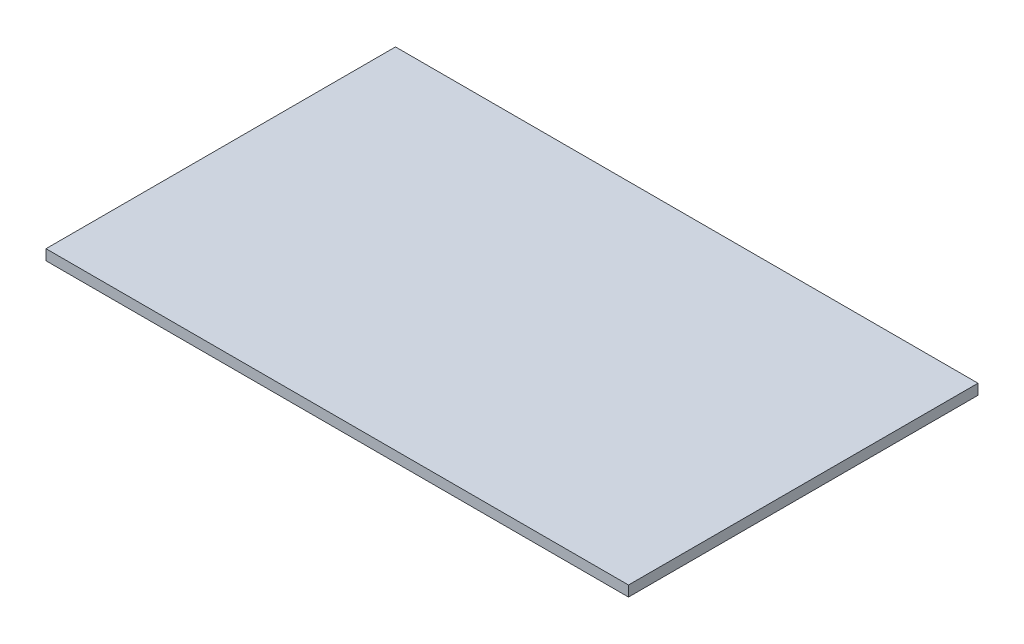
ISO-10303-21;
HEADER;
FILE_DESCRIPTION(('STEP AP214'),'2;1');
FILE_NAME('part.step','',(''),(''),'','','');
FILE_SCHEMA(('AUTOMOTIVE_DESIGN { 1 0 10303 214 1 1 1 1 }'));
ENDSEC;
DATA;
#1=APPLICATION_CONTEXT('core data for automotive mechanical design processes');
#2=APPLICATION_PROTOCOL_DEFINITION('international standard','automotive_design',2000,#1);
#3=PRODUCT_CONTEXT('',#1,'mechanical');
#4=PRODUCT('Part','Part','',(#3));
#5=PRODUCT_RELATED_PRODUCT_CATEGORY('part','',(#4));
#6=PRODUCT_DEFINITION_FORMATION('','',#4);
#7=PRODUCT_DEFINITION_CONTEXT('part definition',#1,'design');
#8=PRODUCT_DEFINITION('design','',#6,#7);
#9=PRODUCT_DEFINITION_SHAPE('','',#8);
#10=(LENGTH_UNIT() NAMED_UNIT(*) SI_UNIT(.MILLI.,.METRE.));
#11=(NAMED_UNIT(*) PLANE_ANGLE_UNIT() SI_UNIT($,.RADIAN.));
#12=(NAMED_UNIT(*) SI_UNIT($,.STERADIAN.) SOLID_ANGLE_UNIT());
#13=UNCERTAINTY_MEASURE_WITH_UNIT(LENGTH_MEASURE(1.E-05),#10,'distance_accuracy_value','');
#14=(GEOMETRIC_REPRESENTATION_CONTEXT(3) GLOBAL_UNCERTAINTY_ASSIGNED_CONTEXT((#13)) GLOBAL_UNIT_ASSIGNED_CONTEXT((#10,
#11,#12)) REPRESENTATION_CONTEXT('',''));
#15=CARTESIAN_POINT('',(0.,0.,0.));
#16=DIRECTION('',(0.,0.,1.));
#17=DIRECTION('',(1.,0.,0.));
#18=AXIS2_PLACEMENT_3D('',#15,#16,#17);
#19=CARTESIAN_POINT('',(0.,18.,0.));
#20=DIRECTION('',(1.,0.,0.));
#21=DIRECTION('',(0.,0.,-1.));
#22=AXIS2_PLACEMENT_3D('',#19,#20,#21);
#23=PLANE('',#22);
#24=DIRECTION('',(0.,0.,1.));
#25=VECTOR('',#24,1.);
#26=CARTESIAN_POINT('',(0.,0.,0.));
#27=LINE('',#26,#25);
#28=CARTESIAN_POINT('',(0.,0.,-600.));
#29=VERTEX_POINT('',#28);
#30=CARTESIAN_POINT('',(0.,0.,0.));
#31=VERTEX_POINT('',#30);
#32=EDGE_CURVE('E98',#29,#31,#27,.T.);
#33=ORIENTED_EDGE('',*,*,#32,.T.);
#34=DIRECTION('',(0.,-1.,0.));
#35=VECTOR('',#34,1.);
#36=CARTESIAN_POINT('',(0.,18.,0.));
#37=LINE('',#36,#35);
#38=CARTESIAN_POINT('',(0.,18.,0.));
#39=VERTEX_POINT('',#38);
#40=EDGE_CURVE('E11',#39,#31,#37,.T.);
#41=ORIENTED_EDGE('',*,*,#40,.F.);
#42=DIRECTION('',(0.,0.,1.));
#43=VECTOR('',#42,1.);
#44=CARTESIAN_POINT('',(0.,18.,0.));
#45=LINE('',#44,#43);
#46=CARTESIAN_POINT('',(0.,18.,-600.));
#47=VERTEX_POINT('',#46);
#48=EDGE_CURVE('E86',#47,#39,#45,.T.);
#49=ORIENTED_EDGE('',*,*,#48,.F.);
#50=DIRECTION('',(0.,-1.,0.));
#51=VECTOR('',#50,1.);
#52=CARTESIAN_POINT('',(0.,18.,-600.));
#53=LINE('',#52,#51);
#54=EDGE_CURVE('E94',#47,#29,#53,.T.);
#55=ORIENTED_EDGE('',*,*,#54,.T.);
#56=EDGE_LOOP('',(#33,#41,#49,#55));
#57=FACE_BOUND('',#56,.T.);
#58=ADVANCED_FACE('F35',(#57),#23,.F.);
#59=CARTESIAN_POINT('',(0.,18.,0.));
#60=DIRECTION('',(0.,0.,-1.));
#61=DIRECTION('',(-1.,0.,0.));
#62=AXIS2_PLACEMENT_3D('',#59,#60,#61);
#63=PLANE('',#62);
#64=DIRECTION('',(1.,0.,0.));
#65=VECTOR('',#64,1.);
#66=CARTESIAN_POINT('',(0.,0.,0.));
#67=LINE('',#66,#65);
#68=CARTESIAN_POINT('',(1000.,0.,0.));
#69=VERTEX_POINT('',#68);
#70=EDGE_CURVE('E90',#31,#69,#67,.T.);
#71=ORIENTED_EDGE('',*,*,#70,.T.);
#72=DIRECTION('',(0.,-1.,0.));
#73=VECTOR('',#72,1.);
#74=CARTESIAN_POINT('',(1000.,18.,0.));
#75=LINE('',#74,#73);
#76=CARTESIAN_POINT('',(1000.,18.,0.));
#77=VERTEX_POINT('',#76);
#78=EDGE_CURVE('E43',#77,#69,#75,.T.);
#79=ORIENTED_EDGE('',*,*,#78,.F.);
#80=DIRECTION('',(1.,0.,0.));
#81=VECTOR('',#80,1.);
#82=CARTESIAN_POINT('',(0.,18.,0.));
#83=LINE('',#82,#81);
#84=EDGE_CURVE('E81',#39,#77,#83,.T.);
#85=ORIENTED_EDGE('',*,*,#84,.F.);
#86=ORIENTED_EDGE('',*,*,#40,.T.);
#87=EDGE_LOOP('',(#71,#79,#85,#86));
#88=FACE_BOUND('',#87,.T.);
#89=ADVANCED_FACE('F89',(#88),#63,.F.);
#90=CARTESIAN_POINT('',(1000.,18.,0.));
#91=DIRECTION('',(-1.,0.,0.));
#92=DIRECTION('',(0.,0.,1.));
#93=AXIS2_PLACEMENT_3D('',#90,#91,#92);
#94=PLANE('',#93);
#95=DIRECTION('',(0.,0.,-1.));
#96=VECTOR('',#95,1.);
#97=CARTESIAN_POINT('',(1000.,0.,0.));
#98=LINE('',#97,#96);
#99=CARTESIAN_POINT('',(1000.,0.,-600.));
#100=VERTEX_POINT('',#99);
#101=EDGE_CURVE('E68',#69,#100,#98,.T.);
#102=ORIENTED_EDGE('',*,*,#101,.T.);
#103=DIRECTION('',(0.,-1.,0.));
#104=VECTOR('',#103,1.);
#105=CARTESIAN_POINT('',(1000.,18.,-600.));
#106=LINE('',#105,#104);
#107=CARTESIAN_POINT('',(1000.,18.,-600.));
#108=VERTEX_POINT('',#107);
#109=EDGE_CURVE('E91',#108,#100,#106,.T.);
#110=ORIENTED_EDGE('',*,*,#109,.F.);
#111=DIRECTION('',(0.,0.,-1.));
#112=VECTOR('',#111,1.);
#113=CARTESIAN_POINT('',(1000.,18.,0.));
#114=LINE('',#113,#112);
#115=EDGE_CURVE('E84',#77,#108,#114,.T.);
#116=ORIENTED_EDGE('',*,*,#115,.F.);
#117=ORIENTED_EDGE('',*,*,#78,.T.);
#118=EDGE_LOOP('',(#102,#110,#116,#117));
#119=FACE_BOUND('',#118,.T.);
#120=ADVANCED_FACE('F92',(#119),#94,.F.);
#121=CARTESIAN_POINT('',(0.,18.,-600.));
#122=DIRECTION('',(0.,0.,1.));
#123=DIRECTION('',(1.,0.,0.));
#124=AXIS2_PLACEMENT_3D('',#121,#122,#123);
#125=PLANE('',#124);
#126=DIRECTION('',(-1.,0.,0.));
#127=VECTOR('',#126,1.);
#128=CARTESIAN_POINT('',(0.,0.,-600.));
#129=LINE('',#128,#127);
#130=EDGE_CURVE('E74',#100,#29,#129,.T.);
#131=ORIENTED_EDGE('',*,*,#130,.T.);
#132=ORIENTED_EDGE('',*,*,#54,.F.);
#133=DIRECTION('',(-1.,0.,0.));
#134=VECTOR('',#133,1.);
#135=CARTESIAN_POINT('',(0.,18.,-600.));
#136=LINE('',#135,#134);
#137=EDGE_CURVE('E51',#108,#47,#136,.T.);
#138=ORIENTED_EDGE('',*,*,#137,.F.);
#139=ORIENTED_EDGE('',*,*,#109,.T.);
#140=EDGE_LOOP('',(#131,#132,#138,#139));
#141=FACE_BOUND('',#140,.T.);
#142=ADVANCED_FACE('F105',(#141),#125,.F.);
#143=CARTESIAN_POINT('',(0.,18.,0.));
#144=DIRECTION('',(0.,-1.,0.));
#145=DIRECTION('',(0.,0.,-1.));
#146=AXIS2_PLACEMENT_3D('',#143,#144,#145);
#147=PLANE('',#146);
#148=ORIENTED_EDGE('',*,*,#48,.T.);
#149=ORIENTED_EDGE('',*,*,#84,.T.);
#150=ORIENTED_EDGE('',*,*,#115,.T.);
#151=ORIENTED_EDGE('',*,*,#137,.T.);
#152=EDGE_LOOP('',(#148,#149,#150,#151));
#153=FACE_BOUND('',#152,.T.);
#154=ADVANCED_FACE('F82',(#153),#147,.F.);
#155=CARTESIAN_POINT('',(0.,0.,0.));
#156=DIRECTION('',(0.,-1.,0.));
#157=DIRECTION('',(0.,0.,-1.));
#158=AXIS2_PLACEMENT_3D('',#155,#156,#157);
#159=PLANE('',#158);
#160=ORIENTED_EDGE('',*,*,#32,.F.);
#161=ORIENTED_EDGE('',*,*,#130,.F.);
#162=ORIENTED_EDGE('',*,*,#101,.F.);
#163=ORIENTED_EDGE('',*,*,#70,.F.);
#164=EDGE_LOOP('',(#160,#161,#162,#163));
#165=FACE_BOUND('',#164,.T.);
#166=ADVANCED_FACE('F108',(#165),#159,.T.);
#167=CLOSED_SHELL('',(#58,#89,#120,#142,#154,#166));
#168=MANIFOLD_SOLID_BREP('B2',#167);
#169=ADVANCED_BREP_SHAPE_REPRESENTATION('',(#18,#168),#14);
#170=SHAPE_DEFINITION_REPRESENTATION(#9,#169);
ENDSEC;
END-ISO-10303-21;
